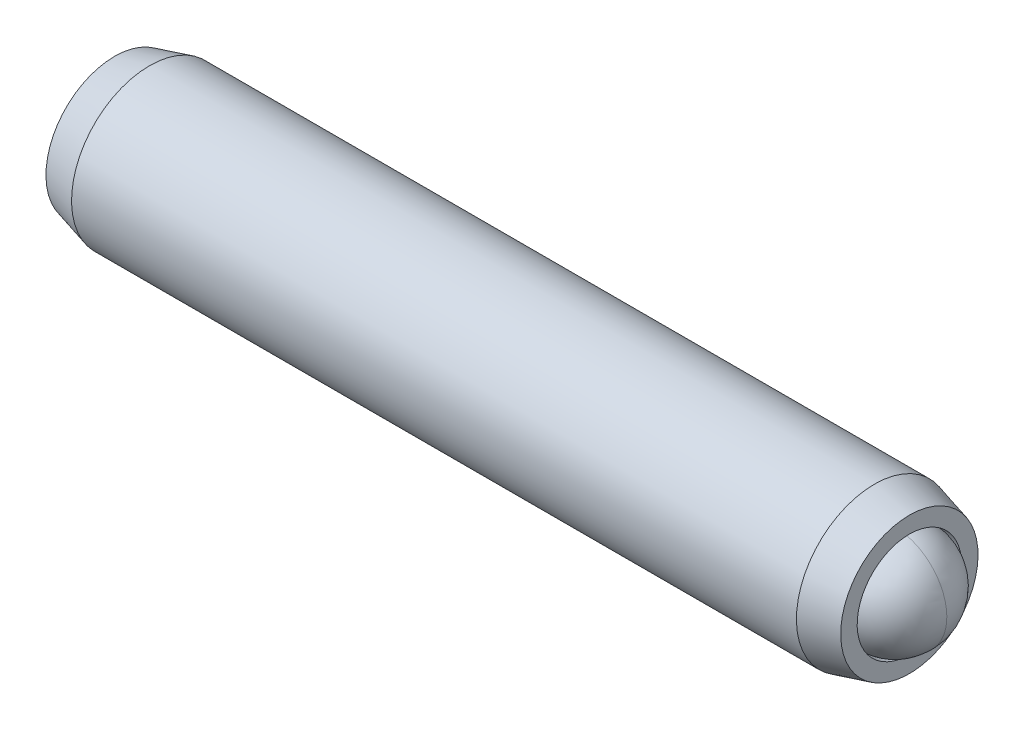
ISO-10303-21;
HEADER;
FILE_DESCRIPTION(('STEP AP214'),'2;1');
FILE_NAME('part.step','',(''),(''),'','','');
FILE_SCHEMA(('AUTOMOTIVE_DESIGN { 1 0 10303 214 1 1 1 1 }'));
ENDSEC;
DATA;
#1=APPLICATION_CONTEXT('core data for automotive mechanical design processes');
#2=APPLICATION_PROTOCOL_DEFINITION('international standard','automotive_design',2000,#1);
#3=PRODUCT_CONTEXT('',#1,'mechanical');
#4=PRODUCT('Part','Part','',(#3));
#5=PRODUCT_RELATED_PRODUCT_CATEGORY('part','',(#4));
#6=PRODUCT_DEFINITION_FORMATION('','',#4);
#7=PRODUCT_DEFINITION_CONTEXT('part definition',#1,'design');
#8=PRODUCT_DEFINITION('design','',#6,#7);
#9=PRODUCT_DEFINITION_SHAPE('','',#8);
#10=(LENGTH_UNIT() NAMED_UNIT(*) SI_UNIT(.MILLI.,.METRE.));
#11=(NAMED_UNIT(*) PLANE_ANGLE_UNIT() SI_UNIT($,.RADIAN.));
#12=(NAMED_UNIT(*) SI_UNIT($,.STERADIAN.) SOLID_ANGLE_UNIT());
#13=UNCERTAINTY_MEASURE_WITH_UNIT(LENGTH_MEASURE(1.E-05),#10,'distance_accuracy_value','');
#14=(GEOMETRIC_REPRESENTATION_CONTEXT(3) GLOBAL_UNCERTAINTY_ASSIGNED_CONTEXT((#13)) GLOBAL_UNIT_ASSIGNED_CONTEXT((#10,
#11,#12)) REPRESENTATION_CONTEXT('',''));
#15=CARTESIAN_POINT('',(0.,0.,0.));
#16=DIRECTION('',(0.,0.,1.));
#17=DIRECTION('',(1.,0.,0.));
#18=AXIS2_PLACEMENT_3D('',#15,#16,#17);
#19=CARTESIAN_POINT('',(-12.7162203856812,1.47543162631791,-0.69225443456844));
#20=DIRECTION('',(-1.,0.,0.));
#21=DIRECTION('',(0.,-1.,0.));
#22=AXIS2_PLACEMENT_3D('',#19,#20,#21);
#23=PLANE('',#22);
#24=DIRECTION('',(0.,0.866025403784439,-0.5));
#25=VECTOR('',#24,1.);
#26=CARTESIAN_POINT('',(-12.7162203856812,1.34843162631791,-2.05790432755285));
#27=LINE('',#26,#25);
#28=CARTESIAN_POINT('',(-12.7162203856812,0.229244126317911,-1.41174112315418));
#29=VERTEX_POINT('',#28);
#30=CARTESIAN_POINT('',(-12.7162203856812,1.47543162631791,-2.13122781173993));
#31=VERTEX_POINT('',#30);
#32=EDGE_CURVE('P0_E164',#29,#31,#27,.T.);
#33=ORIENTED_EDGE('',*,*,#32,.T.);
#34=DIRECTION('',(0.,0.866025403784439,0.5));
#35=VECTOR('',#34,1.);
#36=CARTESIAN_POINT('',(-12.7162203856812,2.59461912631791,-1.48506460734127));
#37=LINE('',#36,#35);
#38=CARTESIAN_POINT('',(-12.7162203856812,2.72161912631791,-1.41174112315419));
#39=VERTEX_POINT('',#38);
#40=EDGE_CURVE('P0_E166',#31,#39,#37,.T.);
#41=ORIENTED_EDGE('',*,*,#40,.T.);
#42=DIRECTION('',(0.,0.,1.));
#43=VECTOR('',#42,1.);
#44=CARTESIAN_POINT('',(-12.7162203856812,2.72161912631791,-0.119414714356858));
#45=LINE('',#44,#43);
#46=CARTESIAN_POINT('',(-12.7162203856812,2.72161912631791,0.0272322540173054));
#47=VERTEX_POINT('',#46);
#48=EDGE_CURVE('P0_E156',#39,#47,#45,.T.);
#49=ORIENTED_EDGE('',*,*,#48,.T.);
#50=DIRECTION('',(0.,-0.866025403784439,0.5));
#51=VECTOR('',#50,1.);
#52=CARTESIAN_POINT('',(-12.7162203856812,1.60243162631791,0.673395458415969));
#53=LINE('',#52,#51);
#54=CARTESIAN_POINT('',(-12.7162203856812,1.47543162631791,0.746718942603051));
#55=VERTEX_POINT('',#54);
#56=EDGE_CURVE('P0_E158',#47,#55,#53,.T.);
#57=ORIENTED_EDGE('',*,*,#56,.T.);
#58=DIRECTION('',(0.,-0.866025403784439,-0.5));
#59=VECTOR('',#58,1.);
#60=CARTESIAN_POINT('',(-12.7162203856812,0.35624412631791,0.100555738204387));
#61=LINE('',#60,#59);
#62=CARTESIAN_POINT('',(-12.7162203856812,0.229244126317912,0.0272322540173054));
#63=VERTEX_POINT('',#62);
#64=EDGE_CURVE('P0_E160',#55,#63,#61,.T.);
#65=ORIENTED_EDGE('',*,*,#64,.T.);
#66=DIRECTION('',(0.,0.,-1.));
#67=VECTOR('',#66,1.);
#68=CARTESIAN_POINT('',(-12.7162203856812,0.229244126317911,-1.26509415478002));
#69=LINE('',#68,#67);
#70=EDGE_CURVE('P0_E162',#63,#29,#69,.T.);
#71=ORIENTED_EDGE('',*,*,#70,.T.);
#72=EDGE_LOOP('',(#33,#41,#49,#57,#65,#71));
#73=FACE_BOUND('',#72,.T.);
#74=CARTESIAN_POINT('',(-12.7162203856812,1.47543162631791,-0.69225443456844));
#75=DIRECTION('',(1.,0.,0.));
#76=DIRECTION('',(0.,1.,0.));
#77=AXIS2_PLACEMENT_3D('',#74,#75,#76);
#78=CIRCLE('',#77,2.0955);
#79=CARTESIAN_POINT('',(-12.7162203856812,3.57093162631791,-0.69225443456844));
#80=VERTEX_POINT('',#79);
#81=EDGE_CURVE('P0_E150',#80,#80,#78,.T.);
#82=ORIENTED_EDGE('',*,*,#81,.F.);
#83=EDGE_LOOP('',(#82));
#84=FACE_BOUND('',#83,.T.);
#85=ADVANCED_FACE('P0_F17',(#73,#84),#23,.T.);
#86=CARTESIAN_POINT('',(-11.6497868674184,1.47543162631791,-0.69225443456844));
#87=DIRECTION('',(1.,0.,0.));
#88=DIRECTION('',(0.,1.,0.));
#89=AXIS2_PLACEMENT_3D('',#86,#87,#88);
#90=CONICAL_SURFACE('',#89,2.38125,0.26179938779915);
#91=ORIENTED_EDGE('',*,*,#81,.T.);
#92=EDGE_LOOP('',(#91));
#93=FACE_BOUND('',#92,.T.);
#94=CARTESIAN_POINT('',(-11.6497868674184,1.47543162631791,-0.69225443456844));
#95=DIRECTION('',(1.,0.,0.));
#96=DIRECTION('',(0.,1.,0.));
#97=AXIS2_PLACEMENT_3D('',#94,#95,#96);
#98=CIRCLE('',#97,2.38125);
#99=CARTESIAN_POINT('',(-11.6497868674184,3.85668162631791,-0.69225443456844));
#100=VERTEX_POINT('',#99);
#101=EDGE_CURVE('P0_E147',#100,#100,#98,.T.);
#102=ORIENTED_EDGE('',*,*,#101,.F.);
#103=EDGE_LOOP('',(#102));
#104=FACE_BOUND('',#103,.T.);
#105=ADVANCED_FACE('P0_F225',(#93,#104),#90,.T.);
#106=CARTESIAN_POINT('',(8.85121558405149,1.47543162631791,-0.69225443456844));
#107=DIRECTION('',(1.,0.,0.));
#108=DIRECTION('',(0.,1.,0.));
#109=AXIS2_PLACEMENT_3D('',#106,#107,#108);
#110=CYLINDRICAL_SURFACE('',#109,2.38125);
#111=ORIENTED_EDGE('',*,*,#101,.T.);
#112=EDGE_LOOP('',(#111));
#113=FACE_BOUND('',#112,.T.);
#114=CARTESIAN_POINT('',(10.474346096056,1.47543162631791,-0.69225443456844));
#115=DIRECTION('',(1.,0.,0.));
#116=DIRECTION('',(0.,1.,0.));
#117=AXIS2_PLACEMENT_3D('',#114,#115,#116);
#118=CIRCLE('',#117,2.38125);
#119=CARTESIAN_POINT('',(10.474346096056,3.85668162631791,-0.69225443456844));
#120=VERTEX_POINT('',#119);
#121=EDGE_CURVE('P0_E144',#120,#120,#118,.T.);
#122=ORIENTED_EDGE('',*,*,#121,.F.);
#123=EDGE_LOOP('',(#122));
#124=FACE_BOUND('',#123,.T.);
#125=ADVANCED_FACE('P0_F231',(#113,#124),#110,.T.);
#126=CARTESIAN_POINT('',(11.5407796143188,1.47543162631791,-0.69225443456844));
#127=DIRECTION('',(-1.,0.,0.));
#128=DIRECTION('',(0.,-1.,0.));
#129=AXIS2_PLACEMENT_3D('',#126,#127,#128);
#130=CONICAL_SURFACE('',#129,2.0955,0.26179938779915);
#131=ORIENTED_EDGE('',*,*,#121,.T.);
#132=EDGE_LOOP('',(#131));
#133=FACE_BOUND('',#132,.T.);
#134=CARTESIAN_POINT('',(11.5407796143188,1.47543162631791,-0.69225443456844));
#135=DIRECTION('',(1.,0.,0.));
#136=DIRECTION('',(0.,1.,0.));
#137=AXIS2_PLACEMENT_3D('',#134,#135,#136);
#138=CIRCLE('',#137,2.0955);
#139=CARTESIAN_POINT('',(11.5407796143188,3.57093162631791,-0.69225443456844));
#140=VERTEX_POINT('',#139);
#141=EDGE_CURVE('P0_E141',#140,#140,#138,.T.);
#142=ORIENTED_EDGE('',*,*,#141,.F.);
#143=EDGE_LOOP('',(#142));
#144=FACE_BOUND('',#143,.T.);
#145=ADVANCED_FACE('P0_F275',(#133,#144),#130,.T.);
#146=CARTESIAN_POINT('',(11.5407796143188,3.57093162631791,-0.69225443456844));
#147=DIRECTION('',(1.,0.,0.));
#148=DIRECTION('',(0.,1.,0.));
#149=AXIS2_PLACEMENT_3D('',#146,#147,#148);
#150=PLANE('',#149);
#151=ORIENTED_EDGE('',*,*,#141,.T.);
#152=EDGE_LOOP('',(#151));
#153=FACE_BOUND('',#152,.T.);
#154=CARTESIAN_POINT('',(11.5407796143188,1.47543162631791,-0.69225443456844));
#155=DIRECTION('',(1.,0.,0.));
#156=DIRECTION('',(0.,1.,0.));
#157=AXIS2_PLACEMENT_3D('',#154,#155,#156);
#158=CIRCLE('',#157,1.59385);
#159=CARTESIAN_POINT('',(11.5407796143188,3.06928162631792,-0.69225443456844));
#160=VERTEX_POINT('',#159);
#161=EDGE_CURVE('P0_E138',#160,#160,#158,.T.);
#162=ORIENTED_EDGE('',*,*,#161,.F.);
#163=EDGE_LOOP('',(#162));
#164=FACE_BOUND('',#163,.T.);
#165=ADVANCED_FACE('P0_F271',(#153,#164),#150,.T.);
#166=CARTESIAN_POINT('',(8.85121558405149,1.47543162631791,-0.69225443456844));
#167=DIRECTION('',(1.,0.,0.));
#168=DIRECTION('',(0.,1.,0.));
#169=AXIS2_PLACEMENT_3D('',#166,#167,#168);
#170=CYLINDRICAL_SURFACE('',#169,1.59385);
#171=ORIENTED_EDGE('',*,*,#161,.T.);
#172=EDGE_LOOP('',(#171));
#173=FACE_BOUND('',#172,.T.);
#174=CARTESIAN_POINT('',(10.4450655840515,1.47543162631791,-0.69225443456844));
#175=DIRECTION('',(1.,0.,0.));
#176=DIRECTION('',(0.,1.,0.));
#177=AXIS2_PLACEMENT_3D('',#174,#175,#176);
#178=CIRCLE('',#177,1.59385);
#179=CARTESIAN_POINT('',(10.4450655840515,3.06928162631792,-0.69225443456844));
#180=VERTEX_POINT('',#179);
#181=EDGE_CURVE('P0_E126',#180,#180,#178,.T.);
#182=ORIENTED_EDGE('',*,*,#181,.F.);
#183=EDGE_LOOP('',(#182));
#184=FACE_BOUND('',#183,.T.);
#185=ADVANCED_FACE('P0_F267',(#173,#184),#170,.F.);
#186=CARTESIAN_POINT('',(8.85121558405149,1.47543162631791,-0.69225443456844));
#187=DIRECTION('',(1.,0.,0.));
#188=DIRECTION('',(0.,1.,0.));
#189=AXIS2_PLACEMENT_3D('',#186,#187,#188);
#190=CONICAL_SURFACE('',#189,0.,0.78539816339745);
#191=ORIENTED_EDGE('',*,*,#181,.T.);
#192=EDGE_LOOP('',(#191));
#193=FACE_BOUND('',#192,.T.);
#194=CARTESIAN_POINT('',(8.85121558405149,1.47543162631791,-0.69225443456844));
#195=VERTEX_POINT('',#194);
#196=VERTEX_LOOP('',#195);
#197=FACE_BOUND('',#196,.T.);
#198=ADVANCED_FACE('P0_F221',(#193,#197),#190,.F.);
#199=CARTESIAN_POINT('',(-9.66822038568122,1.47543162631791,0.453425005854724));
#200=DIRECTION('',(0.,0.5,0.866025403784439));
#201=DIRECTION('',(0.,-0.866025403784439,0.5));
#202=AXIS2_PLACEMENT_3D('',#199,#200,#201);
#203=PLANE('',#202);
#204=DIRECTION('',(-1.,0.,0.));
#205=VECTOR('',#204,1.);
#206=CARTESIAN_POINT('',(-9.66822038568122,1.47543162631791,0.453425005854724));
#207=LINE('',#206,#205);
#208=CARTESIAN_POINT('',(-9.66822038568122,1.47543162631791,0.453425005854724));
#209=VERTEX_POINT('',#208);
#210=CARTESIAN_POINT('',(-12.4622203856812,1.47543162631791,0.453425005854724));
#211=VERTEX_POINT('',#210);
#212=EDGE_CURVE('P0_E124',#209,#211,#207,.T.);
#213=ORIENTED_EDGE('',*,*,#212,.T.);
#214=DIRECTION('',(0.,0.866025403784439,-0.5));
#215=VECTOR('',#214,1.);
#216=CARTESIAN_POINT('',(-12.4622203856812,2.46761912631791,-0.119414714356858));
#217=LINE('',#216,#215);
#218=CARTESIAN_POINT('',(-12.4622203856812,2.46761912631791,-0.119414714356858));
#219=VERTEX_POINT('',#218);
#220=EDGE_CURVE('P0_E26',#211,#219,#217,.T.);
#221=ORIENTED_EDGE('',*,*,#220,.T.);
#222=DIRECTION('',(-1.,0.,0.));
#223=VECTOR('',#222,1.);
#224=CARTESIAN_POINT('',(-9.66822038568122,2.46761912631791,-0.119414714356858));
#225=LINE('',#224,#223);
#226=CARTESIAN_POINT('',(-9.66822038568122,2.46761912631791,-0.119414714356858));
#227=VERTEX_POINT('',#226);
#228=EDGE_CURVE('P0_E90',#227,#219,#225,.T.);
#229=ORIENTED_EDGE('',*,*,#228,.F.);
#230=DIRECTION('',(0.,0.866025403784439,-0.5));
#231=VECTOR('',#230,1.);
#232=CARTESIAN_POINT('',(-9.66822038568122,1.47543162631791,0.453425005854724));
#233=LINE('',#232,#231);
#234=EDGE_CURVE('P0_E94',#209,#227,#233,.T.);
#235=ORIENTED_EDGE('',*,*,#234,.F.);
#236=EDGE_LOOP('',(#213,#221,#229,#235));
#237=FACE_BOUND('',#236,.T.);
#238=ADVANCED_FACE('P0_F92',(#237),#203,.F.);
#239=CARTESIAN_POINT('',(-9.66822038568122,0.483244126317909,-0.119414714356858));
#240=DIRECTION('',(0.,-0.5,0.866025403784439));
#241=DIRECTION('',(0.,-0.866025403784439,-0.5));
#242=AXIS2_PLACEMENT_3D('',#239,#240,#241);
#243=PLANE('',#242);
#244=DIRECTION('',(-1.,0.,0.));
#245=VECTOR('',#244,1.);
#246=CARTESIAN_POINT('',(-9.66822038568122,0.483244126317909,-0.119414714356858));
#247=LINE('',#246,#245);
#248=CARTESIAN_POINT('',(-9.66822038568122,0.483244126317909,-0.119414714356858));
#249=VERTEX_POINT('',#248);
#250=CARTESIAN_POINT('',(-12.4622203856812,0.483244126317909,-0.119414714356858));
#251=VERTEX_POINT('',#250);
#252=EDGE_CURVE('P0_E127',#249,#251,#247,.T.);
#253=ORIENTED_EDGE('',*,*,#252,.T.);
#254=DIRECTION('',(0.,0.866025403784439,0.5));
#255=VECTOR('',#254,1.);
#256=CARTESIAN_POINT('',(-12.4622203856812,1.47543162631791,0.453425005854724));
#257=LINE('',#256,#255);
#258=EDGE_CURVE('P0_E41',#251,#211,#257,.T.);
#259=ORIENTED_EDGE('',*,*,#258,.T.);
#260=ORIENTED_EDGE('',*,*,#212,.F.);
#261=DIRECTION('',(0.,0.866025403784439,0.5));
#262=VECTOR('',#261,1.);
#263=CARTESIAN_POINT('',(-9.66822038568122,0.483244126317909,-0.119414714356858));
#264=LINE('',#263,#262);
#265=EDGE_CURVE('P0_E99',#249,#209,#264,.T.);
#266=ORIENTED_EDGE('',*,*,#265,.F.);
#267=EDGE_LOOP('',(#253,#259,#260,#266));
#268=FACE_BOUND('',#267,.T.);
#269=ADVANCED_FACE('P0_F212',(#268),#243,.F.);
#270=CARTESIAN_POINT('',(-9.66822038568122,0.483244126317909,-1.26509415478002));
#271=DIRECTION('',(0.,-1.,0.));
#272=DIRECTION('',(0.,0.,-1.));
#273=AXIS2_PLACEMENT_3D('',#270,#271,#272);
#274=PLANE('',#273);
#275=DIRECTION('',(-1.,0.,0.));
#276=VECTOR('',#275,1.);
#277=CARTESIAN_POINT('',(-9.66822038568122,0.483244126317909,-1.26509415478002));
#278=LINE('',#277,#276);
#279=CARTESIAN_POINT('',(-9.66822038568122,0.483244126317909,-1.26509415478002));
#280=VERTEX_POINT('',#279);
#281=CARTESIAN_POINT('',(-12.4622203856812,0.483244126317909,-1.26509415478002));
#282=VERTEX_POINT('',#281);
#283=EDGE_CURVE('P0_E129',#280,#282,#278,.T.);
#284=ORIENTED_EDGE('',*,*,#283,.T.);
#285=DIRECTION('',(0.,0.,1.));
#286=VECTOR('',#285,1.);
#287=CARTESIAN_POINT('',(-12.4622203856812,0.483244126317909,-0.119414714356858));
#288=LINE('',#287,#286);
#289=EDGE_CURVE('P0_E171',#282,#251,#288,.T.);
#290=ORIENTED_EDGE('',*,*,#289,.T.);
#291=ORIENTED_EDGE('',*,*,#252,.F.);
#292=DIRECTION('',(0.,0.,1.));
#293=VECTOR('',#292,1.);
#294=CARTESIAN_POINT('',(-9.66822038568122,0.483244126317909,-1.26509415478002));
#295=LINE('',#294,#293);
#296=EDGE_CURVE('P0_E121',#280,#249,#295,.T.);
#297=ORIENTED_EDGE('',*,*,#296,.F.);
#298=EDGE_LOOP('',(#284,#290,#291,#297));
#299=FACE_BOUND('',#298,.T.);
#300=ADVANCED_FACE('P0_F211',(#299),#274,.F.);
#301=CARTESIAN_POINT('',(-9.66822038568122,1.47543162631791,-1.8379338749916));
#302=DIRECTION('',(0.,-0.5,-0.866025403784439));
#303=DIRECTION('',(0.,0.866025403784439,-0.5));
#304=AXIS2_PLACEMENT_3D('',#301,#302,#303);
#305=PLANE('',#304);
#306=DIRECTION('',(-1.,0.,0.));
#307=VECTOR('',#306,1.);
#308=CARTESIAN_POINT('',(-9.66822038568122,1.47543162631791,-1.8379338749916));
#309=LINE('',#308,#307);
#310=CARTESIAN_POINT('',(-9.66822038568122,1.47543162631791,-1.8379338749916));
#311=VERTEX_POINT('',#310);
#312=CARTESIAN_POINT('',(-12.4622203856812,1.47543162631791,-1.8379338749916));
#313=VERTEX_POINT('',#312);
#314=EDGE_CURVE('P0_E132',#311,#313,#309,.T.);
#315=ORIENTED_EDGE('',*,*,#314,.T.);
#316=DIRECTION('',(0.,-0.866025403784439,0.5));
#317=VECTOR('',#316,1.);
#318=CARTESIAN_POINT('',(-12.4622203856812,0.483244126317909,-1.26509415478002));
#319=LINE('',#318,#317);
#320=EDGE_CURVE('P0_E169',#313,#282,#319,.T.);
#321=ORIENTED_EDGE('',*,*,#320,.T.);
#322=ORIENTED_EDGE('',*,*,#283,.F.);
#323=DIRECTION('',(0.,-0.866025403784439,0.5));
#324=VECTOR('',#323,1.);
#325=CARTESIAN_POINT('',(-9.66822038568122,1.47543162631791,-1.8379338749916));
#326=LINE('',#325,#324);
#327=EDGE_CURVE('P0_E118',#311,#280,#326,.T.);
#328=ORIENTED_EDGE('',*,*,#327,.F.);
#329=EDGE_LOOP('',(#315,#321,#322,#328));
#330=FACE_BOUND('',#329,.T.);
#331=ADVANCED_FACE('P0_F208',(#330),#305,.F.);
#332=CARTESIAN_POINT('',(-9.66822038568122,2.46761912631791,-1.26509415478002));
#333=DIRECTION('',(0.,0.5,-0.866025403784439));
#334=DIRECTION('',(0.,0.866025403784439,0.5));
#335=AXIS2_PLACEMENT_3D('',#332,#333,#334);
#336=PLANE('',#335);
#337=DIRECTION('',(-1.,0.,0.));
#338=VECTOR('',#337,1.);
#339=CARTESIAN_POINT('',(-9.66822038568122,2.46761912631791,-1.26509415478002));
#340=LINE('',#339,#338);
#341=CARTESIAN_POINT('',(-9.66822038568122,2.46761912631791,-1.26509415478002));
#342=VERTEX_POINT('',#341);
#343=CARTESIAN_POINT('',(-12.4622203856812,2.46761912631791,-1.26509415478002));
#344=VERTEX_POINT('',#343);
#345=EDGE_CURVE('P0_E98',#342,#344,#340,.T.);
#346=ORIENTED_EDGE('',*,*,#345,.T.);
#347=DIRECTION('',(0.,-0.866025403784439,-0.5));
#348=VECTOR('',#347,1.);
#349=CARTESIAN_POINT('',(-12.4622203856812,1.47543162631791,-1.8379338749916));
#350=LINE('',#349,#348);
#351=EDGE_CURVE('P0_E153',#344,#313,#350,.T.);
#352=ORIENTED_EDGE('',*,*,#351,.T.);
#353=ORIENTED_EDGE('',*,*,#314,.F.);
#354=DIRECTION('',(0.,-0.866025403784439,-0.5));
#355=VECTOR('',#354,1.);
#356=CARTESIAN_POINT('',(-9.66822038568122,2.46761912631791,-1.26509415478002));
#357=LINE('',#356,#355);
#358=EDGE_CURVE('P0_E108',#342,#311,#357,.T.);
#359=ORIENTED_EDGE('',*,*,#358,.F.);
#360=EDGE_LOOP('',(#346,#352,#353,#359));
#361=FACE_BOUND('',#360,.T.);
#362=ADVANCED_FACE('P0_F204',(#361),#336,.F.);
#363=CARTESIAN_POINT('',(-9.66822038568122,2.46761912631791,-0.119414714356858));
#364=DIRECTION('',(0.,1.,0.));
#365=DIRECTION('',(-1.,0.,0.));
#366=AXIS2_PLACEMENT_3D('',#363,#364,#365);
#367=PLANE('',#366);
#368=ORIENTED_EDGE('',*,*,#228,.T.);
#369=DIRECTION('',(0.,0.,-1.));
#370=VECTOR('',#369,1.);
#371=CARTESIAN_POINT('',(-12.4622203856812,2.46761912631791,-1.26509415478002));
#372=LINE('',#371,#370);
#373=EDGE_CURVE('P0_E11',#219,#344,#372,.T.);
#374=ORIENTED_EDGE('',*,*,#373,.T.);
#375=ORIENTED_EDGE('',*,*,#345,.F.);
#376=DIRECTION('',(0.,0.,-1.));
#377=VECTOR('',#376,1.);
#378=CARTESIAN_POINT('',(-9.66822038568122,2.46761912631791,-0.119414714356858));
#379=LINE('',#378,#377);
#380=EDGE_CURVE('P0_E102',#227,#342,#379,.T.);
#381=ORIENTED_EDGE('',*,*,#380,.F.);
#382=EDGE_LOOP('',(#368,#374,#375,#381));
#383=FACE_BOUND('',#382,.T.);
#384=ADVANCED_FACE('P0_F103',(#383),#367,.F.);
#385=CARTESIAN_POINT('',(-9.66822038568122,1.47543162631791,0.453425005854724));
#386=DIRECTION('',(1.,0.,0.));
#387=DIRECTION('',(0.,0.,-1.));
#388=AXIS2_PLACEMENT_3D('',#385,#386,#387);
#389=PLANE('',#388);
#390=ORIENTED_EDGE('',*,*,#234,.T.);
#391=ORIENTED_EDGE('',*,*,#380,.T.);
#392=ORIENTED_EDGE('',*,*,#358,.T.);
#393=ORIENTED_EDGE('',*,*,#327,.T.);
#394=ORIENTED_EDGE('',*,*,#296,.T.);
#395=ORIENTED_EDGE('',*,*,#265,.T.);
#396=EDGE_LOOP('',(#390,#391,#392,#393,#394,#395));
#397=FACE_BOUND('',#396,.T.);
#398=ADVANCED_FACE('P0_F110',(#397),#389,.F.);
#399=CARTESIAN_POINT('',(-12.4622203856812,0.483244126317909,-0.119414714356858));
#400=DIRECTION('',(-0.707106781186543,0.353553390593276,-0.612372435695799));
#401=DIRECTION('',(-0.654653670707982,0.,0.75592894601845));
#402=AXIS2_PLACEMENT_3D('',#399,#400,#401);
#403=PLANE('',#402);
#404=DIRECTION('',(-0.654653670707982,-0.654653670707973,0.377964473009225));
#405=VECTOR('',#404,1.);
#406=CARTESIAN_POINT('',(-12.1787382428241,0.766726269175048,-0.283083205845879));
#407=LINE('',#406,#405);
#408=EDGE_CURVE('P0_E115',#63,#251,#407,.F.);
#409=ORIENTED_EDGE('',*,*,#408,.F.);
#410=ORIENTED_EDGE('',*,*,#64,.F.);
#411=DIRECTION('',(-0.654653670707982,0.,0.75592894601845));
#412=VECTOR('',#411,1.);
#413=CARTESIAN_POINT('',(-12.1787382428241,1.47543162631791,0.126088022876681));
#414=LINE('',#413,#412);
#415=EDGE_CURVE('P0_E21',#211,#55,#414,.T.);
#416=ORIENTED_EDGE('',*,*,#415,.F.);
#417=ORIENTED_EDGE('',*,*,#258,.F.);
#418=EDGE_LOOP('',(#409,#410,#416,#417));
#419=FACE_BOUND('',#418,.T.);
#420=ADVANCED_FACE('P0_F19',(#419),#403,.T.);
#421=CARTESIAN_POINT('',(-12.4622203856812,1.47543162631791,0.453425005854724));
#422=DIRECTION('',(-0.707106781186543,-0.353553390593276,-0.612372435695799));
#423=DIRECTION('',(-0.654653670707982,0.,0.75592894601845));
#424=AXIS2_PLACEMENT_3D('',#421,#422,#423);
#425=PLANE('',#424);
#426=ORIENTED_EDGE('',*,*,#415,.T.);
#427=ORIENTED_EDGE('',*,*,#56,.F.);
#428=DIRECTION('',(-0.654653670707982,0.654653670707973,0.377964473009225));
#429=VECTOR('',#428,1.);
#430=CARTESIAN_POINT('',(-12.1787382428241,2.18413698346077,-0.283083205845879));
#431=LINE('',#430,#429);
#432=EDGE_CURVE('P0_E182',#219,#47,#431,.T.);
#433=ORIENTED_EDGE('',*,*,#432,.F.);
#434=ORIENTED_EDGE('',*,*,#220,.F.);
#435=EDGE_LOOP('',(#426,#427,#433,#434));
#436=FACE_BOUND('',#435,.T.);
#437=ADVANCED_FACE('P0_F196',(#436),#425,.T.);
#438=CARTESIAN_POINT('',(-12.4622203856812,0.483244126317909,-1.26509415478002));
#439=DIRECTION('',(-0.707106781186543,0.707106781186552,0.));
#440=DIRECTION('',(-0.707106781186552,-0.707106781186543,0.));
#441=AXIS2_PLACEMENT_3D('',#438,#439,#440);
#442=PLANE('',#441);
#443=ORIENTED_EDGE('',*,*,#408,.T.);
#444=ORIENTED_EDGE('',*,*,#289,.F.);
#445=DIRECTION('',(-0.654653670707982,-0.654653670707974,-0.377964473009225));
#446=VECTOR('',#445,1.);
#447=CARTESIAN_POINT('',(-12.1787382428241,0.766726269175049,-1.101425663291));
#448=LINE('',#447,#446);
#449=EDGE_CURVE('P0_E179',#29,#282,#448,.F.);
#450=ORIENTED_EDGE('',*,*,#449,.F.);
#451=ORIENTED_EDGE('',*,*,#70,.F.);
#452=EDGE_LOOP('',(#443,#444,#450,#451));
#453=FACE_BOUND('',#452,.T.);
#454=ADVANCED_FACE('P0_F189',(#453),#442,.T.);
#455=CARTESIAN_POINT('',(-12.4622203856812,2.46761912631791,-0.119414714356858));
#456=DIRECTION('',(-0.707106781186543,-0.707106781186552,0.));
#457=DIRECTION('',(0.707106781186552,-0.707106781186543,0.));
#458=AXIS2_PLACEMENT_3D('',#455,#456,#457);
#459=PLANE('',#458);
#460=ORIENTED_EDGE('',*,*,#432,.T.);
#461=ORIENTED_EDGE('',*,*,#48,.F.);
#462=DIRECTION('',(0.654653670707982,-0.654653670707973,0.377964473009225));
#463=VECTOR('',#462,1.);
#464=CARTESIAN_POINT('',(-12.4622203856812,2.46761912631791,-1.26509415478002));
#465=LINE('',#464,#463);
#466=EDGE_CURVE('P0_E177',#344,#39,#465,.F.);
#467=ORIENTED_EDGE('',*,*,#466,.F.);
#468=ORIENTED_EDGE('',*,*,#373,.F.);
#469=EDGE_LOOP('',(#460,#461,#467,#468));
#470=FACE_BOUND('',#469,.T.);
#471=ADVANCED_FACE('P0_F201',(#470),#459,.T.);
#472=CARTESIAN_POINT('',(-12.4622203856812,1.47543162631791,-1.8379338749916));
#473=DIRECTION('',(-0.707106781186543,0.353553390593276,0.612372435695799));
#474=DIRECTION('',(0.654653670707982,0.,0.75592894601845));
#475=AXIS2_PLACEMENT_3D('',#472,#473,#474);
#476=PLANE('',#475);
#477=ORIENTED_EDGE('',*,*,#449,.T.);
#478=ORIENTED_EDGE('',*,*,#320,.F.);
#479=DIRECTION('',(-0.654653670707982,0.,-0.75592894601845));
#480=VECTOR('',#479,1.);
#481=CARTESIAN_POINT('',(-12.1787382428241,1.47543162631791,-1.51059689201356));
#482=LINE('',#481,#480);
#483=EDGE_CURVE('P0_E175',#31,#313,#482,.F.);
#484=ORIENTED_EDGE('',*,*,#483,.F.);
#485=ORIENTED_EDGE('',*,*,#32,.F.);
#486=EDGE_LOOP('',(#477,#478,#484,#485));
#487=FACE_BOUND('',#486,.T.);
#488=ADVANCED_FACE('P0_F240',(#487),#476,.T.);
#489=CARTESIAN_POINT('',(-12.4622203856812,2.46761912631791,-1.26509415478002));
#490=DIRECTION('',(-0.707106781186542,-0.353553390593276,0.612372435695799));
#491=DIRECTION('',(0.654653670707983,0.,0.75592894601845));
#492=AXIS2_PLACEMENT_3D('',#489,#490,#491);
#493=PLANE('',#492);
#494=ORIENTED_EDGE('',*,*,#466,.T.);
#495=ORIENTED_EDGE('',*,*,#40,.F.);
#496=ORIENTED_EDGE('',*,*,#483,.T.);
#497=ORIENTED_EDGE('',*,*,#351,.F.);
#498=EDGE_LOOP('',(#494,#495,#496,#497));
#499=FACE_BOUND('',#498,.T.);
#500=ADVANCED_FACE('P0_F237',(#499),#493,.T.);
#501=CLOSED_SHELL('',(#85,#105,#125,#145,#165,#185,#198,#238,#269,#300,#331,#362,#384,#398,#420,
#437,#454,#471,#488,#500));
#502=MANIFOLD_SOLID_BREP('P0_B1',#501);
#503=CARTESIAN_POINT('',(11.0962796143188,1.47543162631791,-0.69225443456844));
#504=DIRECTION('',(0.,-0.999896754381588,-0.0143694320405187));
#505=DIRECTION('',(1.,0.,0.));
#506=AXIS2_PLACEMENT_3D('',#503,#504,#505);
#507=SPHERICAL_SURFACE('',#506,1.5875);
#508=CARTESIAN_POINT('',(11.0962796143188,1.47543162631791,-0.69225443456844));
#509=DIRECTION('',(0.,-0.0143694320405187,0.999896754381588));
#510=DIRECTION('',(1.,0.,0.));
#511=AXIS2_PLACEMENT_3D('',#508,#509,#510);
#512=CIRCLE('',#511,1.5875);
#513=CARTESIAN_POINT('',(11.0962796143188,3.06276772389868,-0.669442961204117));
#514=VERTEX_POINT('',#513);
#515=CARTESIAN_POINT('',(11.0962796143188,-0.111904471262856,-0.715065907932764));
#516=VERTEX_POINT('',#515);
#517=EDGE_CURVE('P1_E37',#514,#516,#512,.T.);
#518=ORIENTED_EDGE('',*,*,#517,.F.);
#519=CARTESIAN_POINT('',(11.0962796143188,1.47543162631791,-0.69225443456844));
#520=DIRECTION('',(-1.,0.,0.));
#521=DIRECTION('',(0.,-0.0143694320405187,0.999896754381588));
#522=AXIS2_PLACEMENT_3D('',#519,#520,#521);
#523=CIRCLE('',#522,1.5875);
#524=EDGE_CURVE('P1_E10',#514,#516,#523,.T.);
#525=ORIENTED_EDGE('',*,*,#524,.T.);
#526=EDGE_LOOP('',(#518,#525));
#527=FACE_BOUND('',#526,.T.);
#528=ADVANCED_FACE('P1_F16',(#527),#507,.T.);
#529=ORIENTED_EDGE('',*,*,#517,.T.);
#530=CARTESIAN_POINT('',(11.0962796143188,1.47543162631791,-0.69225443456844));
#531=DIRECTION('',(-1.,0.,0.));
#532=DIRECTION('',(0.,-0.0143694320405187,0.999896754381588));
#533=AXIS2_PLACEMENT_3D('',#530,#531,#532);
#534=CIRCLE('',#533,1.5875);
#535=EDGE_CURVE('P1_E23',#516,#514,#534,.T.);
#536=ORIENTED_EDGE('',*,*,#535,.T.);
#537=EDGE_LOOP('',(#529,#536));
#538=FACE_BOUND('',#537,.T.);
#539=ADVANCED_FACE('P1_F36',(#538),#507,.T.);
#540=ORIENTED_EDGE('',*,*,#535,.F.);
#541=EDGE_CURVE('P1_E33',#516,#514,#512,.T.);
#542=ORIENTED_EDGE('',*,*,#541,.T.);
#543=EDGE_LOOP('',(#540,#542));
#544=FACE_BOUND('',#543,.T.);
#545=ADVANCED_FACE('P1_F39',(#544),#507,.T.);
#546=ORIENTED_EDGE('',*,*,#524,.F.);
#547=ORIENTED_EDGE('',*,*,#541,.F.);
#548=EDGE_LOOP('',(#546,#547));
#549=FACE_BOUND('',#548,.T.);
#550=ADVANCED_FACE('P1_F18',(#549),#507,.T.);
#551=CLOSED_SHELL('',(#528,#539,#545,#550));
#552=MANIFOLD_SOLID_BREP('P1_B1',#551);
#553=ADVANCED_BREP_SHAPE_REPRESENTATION('',(#18,#502,#552),#14);
#554=SHAPE_DEFINITION_REPRESENTATION(#9,#553);
ENDSEC;
END-ISO-10303-21;
